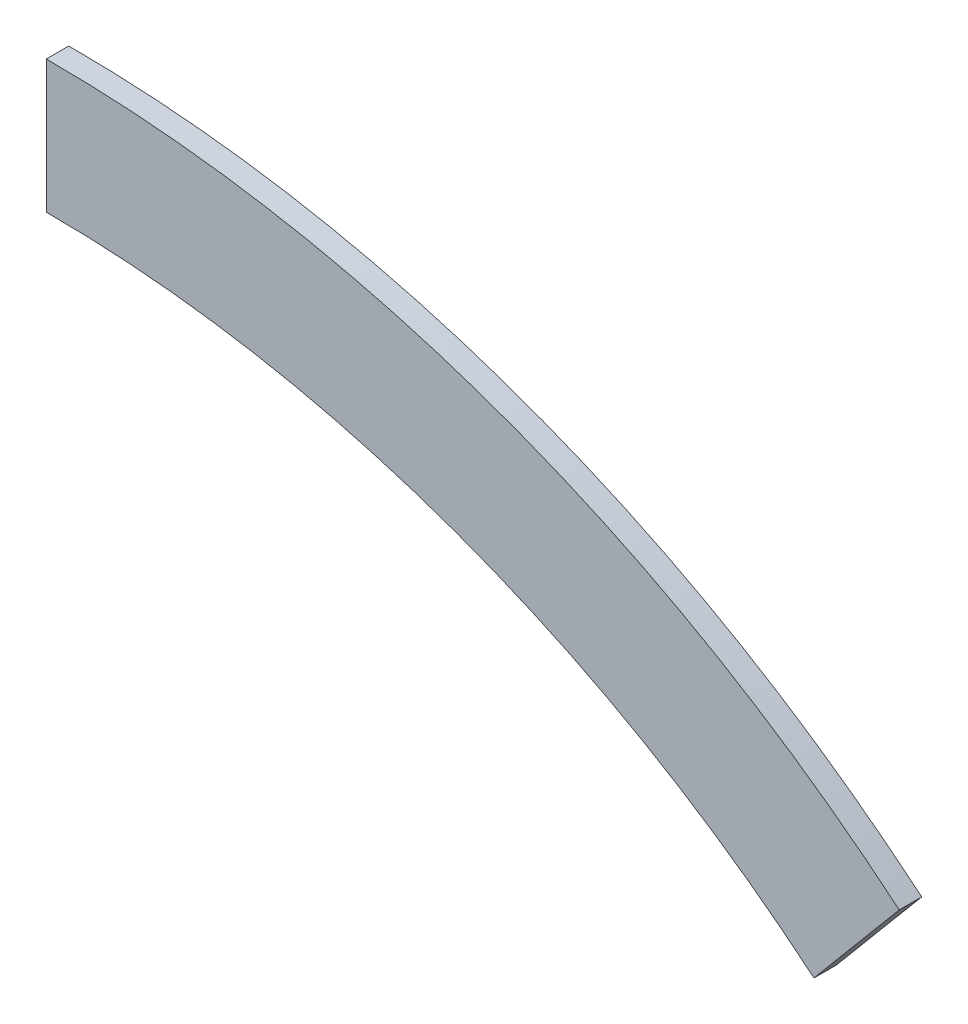
ISO-10303-21;
HEADER;
FILE_DESCRIPTION(('STEP AP214'),'2;1');
FILE_NAME('part.step','',(''),(''),'','','');
FILE_SCHEMA(('AUTOMOTIVE_DESIGN { 1 0 10303 214 1 1 1 1 }'));
ENDSEC;
DATA;
#1=APPLICATION_CONTEXT('core data for automotive mechanical design processes');
#2=APPLICATION_PROTOCOL_DEFINITION('international standard','automotive_design',2000,#1);
#3=PRODUCT_CONTEXT('',#1,'mechanical');
#4=PRODUCT('Part','Part','',(#3));
#5=PRODUCT_RELATED_PRODUCT_CATEGORY('part','',(#4));
#6=PRODUCT_DEFINITION_FORMATION('','',#4);
#7=PRODUCT_DEFINITION_CONTEXT('part definition',#1,'design');
#8=PRODUCT_DEFINITION('design','',#6,#7);
#9=PRODUCT_DEFINITION_SHAPE('','',#8);
#10=(LENGTH_UNIT() NAMED_UNIT(*) SI_UNIT(.MILLI.,.METRE.));
#11=(NAMED_UNIT(*) PLANE_ANGLE_UNIT() SI_UNIT($,.RADIAN.));
#12=(NAMED_UNIT(*) SI_UNIT($,.STERADIAN.) SOLID_ANGLE_UNIT());
#13=UNCERTAINTY_MEASURE_WITH_UNIT(LENGTH_MEASURE(1.E-05),#10,'distance_accuracy_value','');
#14=(GEOMETRIC_REPRESENTATION_CONTEXT(3) GLOBAL_UNCERTAINTY_ASSIGNED_CONTEXT((#13)) GLOBAL_UNIT_ASSIGNED_CONTEXT((#10,
#11,#12)) REPRESENTATION_CONTEXT('',''));
#15=CARTESIAN_POINT('',(0.,0.,0.));
#16=DIRECTION('',(0.,0.,1.));
#17=DIRECTION('',(1.,0.,0.));
#18=AXIS2_PLACEMENT_3D('',#15,#16,#17);
#19=CARTESIAN_POINT('',(0.,0.,3.175));
#20=DIRECTION('',(0.,0.,1.));
#21=DIRECTION('',(1.,0.,0.));
#22=AXIS2_PLACEMENT_3D('',#19,#20,#21);
#23=PLANE('',#22);
#24=CARTESIAN_POINT('',(0.,0.,3.175));
#25=DIRECTION('',(0.,0.,1.));
#26=DIRECTION('',(1.,0.,0.));
#27=AXIS2_PLACEMENT_3D('',#24,#25,#26);
#28=CIRCLE('',#27,168.656);
#29=CARTESIAN_POINT('',(108.409987099295,129.197991598673,3.175));
#30=VERTEX_POINT('',#29);
#31=CARTESIAN_POINT('',(0.,168.656,3.175));
#32=VERTEX_POINT('',#31);
#33=EDGE_CURVE('E76',#30,#32,#28,.T.);
#34=ORIENTED_EDGE('',*,*,#33,.F.);
#35=DIRECTION('',(0.642787609686557,0.766044443118963,0.));
#36=VECTOR('',#35,1.);
#37=CARTESIAN_POINT('',(-8.39849176403869E-13,7.04717134165062E-13,3.175));
#38=LINE('',#37,#36);
#39=CARTESIAN_POINT('',(120.451005997749,143.547919129398,3.175));
#40=VERTEX_POINT('',#39);
#41=EDGE_CURVE('E79',#30,#40,#38,.T.);
#42=ORIENTED_EDGE('',*,*,#41,.T.);
#43=CARTESIAN_POINT('',(0.,0.,3.175));
#44=DIRECTION('',(0.,0.,1.));
#45=DIRECTION('',(1.,0.,0.));
#46=AXIS2_PLACEMENT_3D('',#43,#44,#45);
#47=CIRCLE('',#46,187.3885);
#48=CARTESIAN_POINT('',(0.,187.3885,3.175));
#49=VERTEX_POINT('',#48);
#50=EDGE_CURVE('E54',#40,#49,#47,.T.);
#51=ORIENTED_EDGE('',*,*,#50,.T.);
#52=DIRECTION('',(0.,1.,0.));
#53=VECTOR('',#52,1.);
#54=CARTESIAN_POINT('',(0.,0.,3.175));
#55=LINE('',#54,#53);
#56=EDGE_CURVE('E74',#32,#49,#55,.T.);
#57=ORIENTED_EDGE('',*,*,#56,.F.);
#58=EDGE_LOOP('',(#34,#42,#51,#57));
#59=FACE_BOUND('',#58,.T.);
#60=ADVANCED_FACE('F32',(#59),#23,.T.);
#61=CARTESIAN_POINT('',(0.,49.6794513874194,-0.01));
#62=DIRECTION('',(1.,0.,0.));
#63=DIRECTION('',(0.,1.,0.));
#64=AXIS2_PLACEMENT_3D('',#61,#62,#63);
#65=PLANE('',#64);
#66=DIRECTION('',(0.,0.,-1.));
#67=VECTOR('',#66,1.);
#68=CARTESIAN_POINT('',(0.,168.656,3.175));
#69=LINE('',#68,#67);
#70=CARTESIAN_POINT('',(0.,168.656,0.));
#71=VERTEX_POINT('',#70);
#72=EDGE_CURVE('E11',#71,#32,#69,.F.);
#73=ORIENTED_EDGE('',*,*,#72,.T.);
#74=ORIENTED_EDGE('',*,*,#56,.T.);
#75=DIRECTION('',(0.,0.,-1.));
#76=VECTOR('',#75,1.);
#77=CARTESIAN_POINT('',(0.,187.3885,3.175));
#78=LINE('',#77,#76);
#79=CARTESIAN_POINT('',(0.,187.3885,0.));
#80=VERTEX_POINT('',#79);
#81=EDGE_CURVE('E110',#80,#49,#78,.F.);
#82=ORIENTED_EDGE('',*,*,#81,.F.);
#83=DIRECTION('',(0.,1.,0.));
#84=VECTOR('',#83,1.);
#85=CARTESIAN_POINT('',(0.,0.,0.));
#86=LINE('',#85,#84);
#87=EDGE_CURVE('E46',#71,#80,#86,.T.);
#88=ORIENTED_EDGE('',*,*,#87,.F.);
#89=EDGE_LOOP('',(#73,#74,#82,#88));
#90=FACE_BOUND('',#89,.T.);
#91=ADVANCED_FACE('F87',(#90),#65,.F.);
#92=CARTESIAN_POINT('',(0.,0.,0.));
#93=DIRECTION('',(0.,0.,1.));
#94=DIRECTION('',(1.,0.,0.));
#95=AXIS2_PLACEMENT_3D('',#92,#93,#94);
#96=PLANE('',#95);
#97=DIRECTION('',(0.642787609686557,0.766044443118963,0.));
#98=VECTOR('',#97,1.);
#99=CARTESIAN_POINT('',(-8.39849176403869E-13,7.04717134165062E-13,0.));
#100=LINE('',#99,#98);
#101=CARTESIAN_POINT('',(108.409987099295,129.197991598673,0.));
#102=VERTEX_POINT('',#101);
#103=CARTESIAN_POINT('',(120.451005997749,143.547919129398,0.));
#104=VERTEX_POINT('',#103);
#105=EDGE_CURVE('E78',#102,#104,#100,.T.);
#106=ORIENTED_EDGE('',*,*,#105,.F.);
#107=CARTESIAN_POINT('',(0.,0.,0.));
#108=DIRECTION('',(0.,0.,1.));
#109=DIRECTION('',(1.,0.,0.));
#110=AXIS2_PLACEMENT_3D('',#107,#108,#109);
#111=CIRCLE('',#110,168.656);
#112=EDGE_CURVE('E85',#102,#71,#111,.T.);
#113=ORIENTED_EDGE('',*,*,#112,.T.);
#114=ORIENTED_EDGE('',*,*,#87,.T.);
#115=CARTESIAN_POINT('',(0.,0.,0.));
#116=DIRECTION('',(0.,0.,1.));
#117=DIRECTION('',(1.,0.,0.));
#118=AXIS2_PLACEMENT_3D('',#115,#116,#117);
#119=CIRCLE('',#118,187.3885);
#120=EDGE_CURVE('E114',#104,#80,#119,.T.);
#121=ORIENTED_EDGE('',*,*,#120,.F.);
#122=EDGE_LOOP('',(#106,#113,#114,#121));
#123=FACE_BOUND('',#122,.T.);
#124=ADVANCED_FACE('F89',(#123),#96,.F.);
#125=CARTESIAN_POINT('',(31.933335807858,38.056667672532,-0.01));
#126=DIRECTION('',(0.766044443118963,-0.642787609686557,0.));
#127=DIRECTION('',(0.642787609686557,0.766044443118963,0.));
#128=AXIS2_PLACEMENT_3D('',#125,#126,#127);
#129=PLANE('',#128);
#130=ORIENTED_EDGE('',*,*,#41,.F.);
#131=DIRECTION('',(0.,0.,-1.));
#132=VECTOR('',#131,1.);
#133=CARTESIAN_POINT('',(108.409987099295,129.197991598673,3.175));
#134=LINE('',#133,#132);
#135=EDGE_CURVE('E84',#102,#30,#134,.F.);
#136=ORIENTED_EDGE('',*,*,#135,.F.);
#137=ORIENTED_EDGE('',*,*,#105,.T.);
#138=DIRECTION('',(0.,0.,-1.));
#139=VECTOR('',#138,1.);
#140=CARTESIAN_POINT('',(120.451005997749,143.547919129398,3.175));
#141=LINE('',#140,#139);
#142=EDGE_CURVE('E40',#104,#40,#141,.F.);
#143=ORIENTED_EDGE('',*,*,#142,.T.);
#144=EDGE_LOOP('',(#130,#136,#137,#143));
#145=FACE_BOUND('',#144,.T.);
#146=ADVANCED_FACE('F95',(#145),#129,.T.);
#147=CARTESIAN_POINT('',(0.,0.,3.175));
#148=DIRECTION('',(0.,0.,-1.));
#149=DIRECTION('',(-1.,0.,0.));
#150=AXIS2_PLACEMENT_3D('',#147,#148,#149);
#151=CYLINDRICAL_SURFACE('',#150,187.3885);
#152=ORIENTED_EDGE('',*,*,#142,.F.);
#153=ORIENTED_EDGE('',*,*,#120,.T.);
#154=ORIENTED_EDGE('',*,*,#81,.T.);
#155=ORIENTED_EDGE('',*,*,#50,.F.);
#156=EDGE_LOOP('',(#152,#153,#154,#155));
#157=FACE_BOUND('',#156,.T.);
#158=ADVANCED_FACE('F100',(#157),#151,.T.);
#159=CARTESIAN_POINT('',(0.,0.,3.175));
#160=DIRECTION('',(0.,0.,-1.));
#161=DIRECTION('',(-1.,0.,0.));
#162=AXIS2_PLACEMENT_3D('',#159,#160,#161);
#163=CYLINDRICAL_SURFACE('',#162,168.656);
#164=ORIENTED_EDGE('',*,*,#135,.T.);
#165=ORIENTED_EDGE('',*,*,#33,.T.);
#166=ORIENTED_EDGE('',*,*,#72,.F.);
#167=ORIENTED_EDGE('',*,*,#112,.F.);
#168=EDGE_LOOP('',(#164,#165,#166,#167));
#169=FACE_BOUND('',#168,.T.);
#170=ADVANCED_FACE('F34',(#169),#163,.F.);
#171=CLOSED_SHELL('',(#60,#91,#124,#146,#158,#170));
#172=MANIFOLD_SOLID_BREP('B2',#171);
#173=ADVANCED_BREP_SHAPE_REPRESENTATION('',(#18,#172),#14);
#174=SHAPE_DEFINITION_REPRESENTATION(#9,#173);
ENDSEC;
END-ISO-10303-21;
